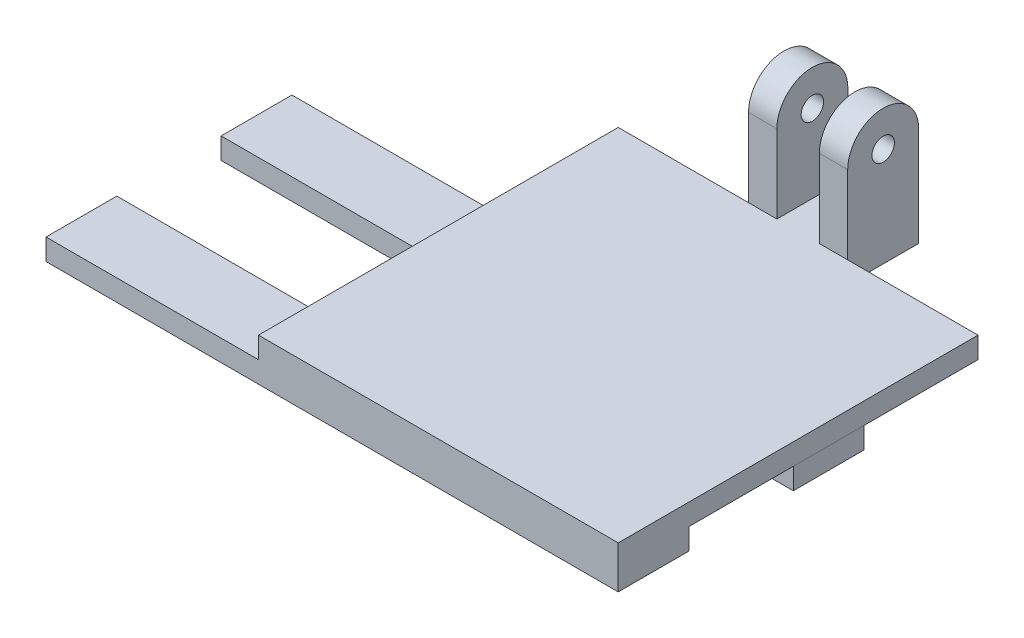
ISO-10303-21;
HEADER;
FILE_DESCRIPTION(('STEP AP214'),'2;1');
FILE_NAME('part.step','',(''),(''),'','','');
FILE_SCHEMA(('AUTOMOTIVE_DESIGN { 1 0 10303 214 1 1 1 1 }'));
ENDSEC;
DATA;
#1=APPLICATION_CONTEXT('core data for automotive mechanical design processes');
#2=APPLICATION_PROTOCOL_DEFINITION('international standard','automotive_design',2000,#1);
#3=PRODUCT_CONTEXT('',#1,'mechanical');
#4=PRODUCT('Part','Part','',(#3));
#5=PRODUCT_RELATED_PRODUCT_CATEGORY('part','',(#4));
#6=PRODUCT_DEFINITION_FORMATION('','',#4);
#7=PRODUCT_DEFINITION_CONTEXT('part definition',#1,'design');
#8=PRODUCT_DEFINITION('design','',#6,#7);
#9=PRODUCT_DEFINITION_SHAPE('','',#8);
#10=(LENGTH_UNIT() NAMED_UNIT(*) SI_UNIT(.MILLI.,.METRE.));
#11=(NAMED_UNIT(*) PLANE_ANGLE_UNIT() SI_UNIT($,.RADIAN.));
#12=(NAMED_UNIT(*) SI_UNIT($,.STERADIAN.) SOLID_ANGLE_UNIT());
#13=UNCERTAINTY_MEASURE_WITH_UNIT(LENGTH_MEASURE(1.E-05),#10,'distance_accuracy_value','');
#14=(GEOMETRIC_REPRESENTATION_CONTEXT(3) GLOBAL_UNCERTAINTY_ASSIGNED_CONTEXT((#13)) GLOBAL_UNIT_ASSIGNED_CONTEXT((#10,
#11,#12)) REPRESENTATION_CONTEXT('',''));
#15=CARTESIAN_POINT('',(0.,0.,0.));
#16=DIRECTION('',(0.,0.,1.));
#17=DIRECTION('',(1.,0.,0.));
#18=AXIS2_PLACEMENT_3D('',#15,#16,#17);
#19=CARTESIAN_POINT('',(0.,0.,0.));
#20=DIRECTION('',(0.,1.,0.));
#21=DIRECTION('',(0.,0.,1.));
#22=AXIS2_PLACEMENT_3D('',#19,#20,#21);
#23=PLANE('',#22);
#24=DIRECTION('',(-1.,0.,0.));
#25=VECTOR('',#24,1.);
#26=CARTESIAN_POINT('',(50.7963795894382,0.,-24.7232161308185));
#27=LINE('',#26,#25);
#28=CARTESIAN_POINT('',(50.7963795894382,0.,-24.7232161308185));
#29=VERTEX_POINT('',#28);
#30=CARTESIAN_POINT('',(0.,0.,-24.7232161308185));
#31=VERTEX_POINT('',#30);
#32=EDGE_CURVE('E57',#29,#31,#27,.T.);
#33=ORIENTED_EDGE('',*,*,#32,.F.);
#34=DIRECTION('',(0.,0.,1.));
#35=VECTOR('',#34,1.);
#36=CARTESIAN_POINT('',(50.7963795894382,0.,-24.7232161308185));
#37=LINE('',#36,#35);
#38=CARTESIAN_POINT('',(50.7963795894382,0.,-34.7232161308185));
#39=VERTEX_POINT('',#38);
#40=EDGE_CURVE('E62',#39,#29,#37,.T.);
#41=ORIENTED_EDGE('',*,*,#40,.F.);
#42=DIRECTION('',(1.,0.,0.));
#43=VECTOR('',#42,1.);
#44=CARTESIAN_POINT('',(50.7963795894382,0.,-34.7232161308185));
#45=LINE('',#44,#43);
#46=CARTESIAN_POINT('',(0.,0.,-34.7232161308185));
#47=VERTEX_POINT('',#46);
#48=EDGE_CURVE('E652',#47,#39,#45,.T.);
#49=ORIENTED_EDGE('',*,*,#48,.F.);
#50=DIRECTION('',(0.,0.,-1.));
#51=VECTOR('',#50,1.);
#52=CARTESIAN_POINT('',(0.,0.,0.));
#53=LINE('',#52,#51);
#54=CARTESIAN_POINT('',(0.,0.,-50.8));
#55=VERTEX_POINT('',#54);
#56=EDGE_CURVE('E326',#47,#55,#53,.T.);
#57=ORIENTED_EDGE('',*,*,#56,.T.);
#58=DIRECTION('',(1.,0.,0.));
#59=VECTOR('',#58,1.);
#60=CARTESIAN_POINT('',(0.,0.,-50.8));
#61=LINE('',#60,#59);
#62=CARTESIAN_POINT('',(18.4,0.,-50.8));
#63=VERTEX_POINT('',#62);
#64=EDGE_CURVE('E320',#55,#63,#61,.T.);
#65=ORIENTED_EDGE('',*,*,#64,.T.);
#66=DIRECTION('',(0.,0.,-1.));
#67=VECTOR('',#66,1.);
#68=CARTESIAN_POINT('',(18.4,0.,0.));
#69=LINE('',#68,#67);
#70=CARTESIAN_POINT('',(18.4,0.,-60.8232031516567));
#71=VERTEX_POINT('',#70);
#72=EDGE_CURVE('E262',#63,#71,#69,.T.);
#73=ORIENTED_EDGE('',*,*,#72,.T.);
#74=DIRECTION('',(1.,0.,0.));
#75=VECTOR('',#74,1.);
#76=CARTESIAN_POINT('',(0.,0.,-60.8232031516567));
#77=LINE('',#76,#75);
#78=CARTESIAN_POINT('',(32.4,0.,-60.8232031516567));
#79=VERTEX_POINT('',#78);
#80=EDGE_CURVE('E319',#71,#79,#77,.T.);
#81=ORIENTED_EDGE('',*,*,#80,.T.);
#82=DIRECTION('',(0.,0.,-1.));
#83=VECTOR('',#82,1.);
#84=CARTESIAN_POINT('',(32.4,0.,0.));
#85=LINE('',#84,#83);
#86=CARTESIAN_POINT('',(32.4,0.,-50.8));
#87=VERTEX_POINT('',#86);
#88=EDGE_CURVE('E277',#87,#79,#85,.T.);
#89=ORIENTED_EDGE('',*,*,#88,.F.);
#90=CARTESIAN_POINT('',(50.8,0.,-50.8));
#91=VERTEX_POINT('',#90);
#92=EDGE_CURVE('E316',#87,#91,#61,.T.);
#93=ORIENTED_EDGE('',*,*,#92,.T.);
#94=DIRECTION('',(0.,0.,-1.));
#95=VECTOR('',#94,1.);
#96=CARTESIAN_POINT('',(50.8,0.,0.));
#97=LINE('',#96,#95);
#98=CARTESIAN_POINT('',(50.8,0.,-10.));
#99=VERTEX_POINT('',#98);
#100=EDGE_CURVE('E289',#99,#91,#97,.T.);
#101=ORIENTED_EDGE('',*,*,#100,.F.);
#102=DIRECTION('',(1.,0.,0.));
#103=VECTOR('',#102,1.);
#104=CARTESIAN_POINT('',(-30.,0.,-10.));
#105=LINE('',#104,#103);
#106=CARTESIAN_POINT('',(0.,0.,-10.));
#107=VERTEX_POINT('',#106);
#108=EDGE_CURVE('E11',#107,#99,#105,.T.);
#109=ORIENTED_EDGE('',*,*,#108,.F.);
#110=EDGE_CURVE('E325',#107,#31,#53,.T.);
#111=ORIENTED_EDGE('',*,*,#110,.T.);
#112=EDGE_LOOP('',(#33,#41,#49,#57,#65,#73,#81,#89,#93,#101,#109,#111));
#113=FACE_BOUND('',#112,.T.);
#114=ADVANCED_FACE('F39',(#113),#23,.F.);
#115=CARTESIAN_POINT('',(0.,3.,-50.8));
#116=DIRECTION('',(0.,0.,-1.));
#117=DIRECTION('',(-1.,0.,0.));
#118=AXIS2_PLACEMENT_3D('',#115,#116,#117);
#119=PLANE('',#118);
#120=ORIENTED_EDGE('',*,*,#92,.F.);
#121=DIRECTION('',(0.,-1.,0.));
#122=VECTOR('',#121,1.);
#123=CARTESIAN_POINT('',(32.4,19.05,-50.8));
#124=LINE('',#123,#122);
#125=CARTESIAN_POINT('',(32.4,3.00000000000001,-50.8));
#126=VERTEX_POINT('',#125);
#127=EDGE_CURVE('E284',#126,#87,#124,.T.);
#128=ORIENTED_EDGE('',*,*,#127,.F.);
#129=DIRECTION('',(1.,0.,0.));
#130=VECTOR('',#129,1.);
#131=CARTESIAN_POINT('',(0.,3.,-50.8));
#132=LINE('',#131,#130);
#133=CARTESIAN_POINT('',(50.8,3.,-50.8));
#134=VERTEX_POINT('',#133);
#135=EDGE_CURVE('E297',#126,#134,#132,.T.);
#136=ORIENTED_EDGE('',*,*,#135,.T.);
#137=DIRECTION('',(0.,-1.,0.));
#138=VECTOR('',#137,1.);
#139=CARTESIAN_POINT('',(50.8,3.,-50.8));
#140=LINE('',#139,#138);
#141=EDGE_CURVE('E331',#134,#91,#140,.T.);
#142=ORIENTED_EDGE('',*,*,#141,.T.);
#143=EDGE_LOOP('',(#120,#128,#136,#142));
#144=FACE_BOUND('',#143,.T.);
#145=ADVANCED_FACE('F359',(#144),#119,.T.);
#146=CARTESIAN_POINT('',(0.,3.,0.));
#147=DIRECTION('',(0.,0.,-1.));
#148=DIRECTION('',(-1.,0.,0.));
#149=AXIS2_PLACEMENT_3D('',#146,#147,#148);
#150=PLANE('',#149);
#151=DIRECTION('',(0.,-1.,0.));
#152=VECTOR('',#151,1.);
#153=CARTESIAN_POINT('',(0.,3.,0.));
#154=LINE('',#153,#152);
#155=CARTESIAN_POINT('',(0.,3.,0.));
#156=VERTEX_POINT('',#155);
#157=CARTESIAN_POINT('',(0.,0.,0.));
#158=VERTEX_POINT('',#157);
#159=EDGE_CURVE('E314',#156,#158,#154,.T.);
#160=ORIENTED_EDGE('',*,*,#159,.T.);
#161=DIRECTION('',(-1.,0.,0.));
#162=VECTOR('',#161,1.);
#163=CARTESIAN_POINT('',(0.,0.,0.));
#164=LINE('',#163,#162);
#165=CARTESIAN_POINT('',(-30.,0.,0.));
#166=VERTEX_POINT('',#165);
#167=EDGE_CURVE('E210',#158,#166,#164,.T.);
#168=ORIENTED_EDGE('',*,*,#167,.T.);
#169=DIRECTION('',(0.,1.,0.));
#170=VECTOR('',#169,1.);
#171=CARTESIAN_POINT('',(-30.,-3.,0.));
#172=LINE('',#171,#170);
#173=CARTESIAN_POINT('',(-30.,-3.,0.));
#174=VERTEX_POINT('',#173);
#175=EDGE_CURVE('E235',#174,#166,#172,.T.);
#176=ORIENTED_EDGE('',*,*,#175,.F.);
#177=DIRECTION('',(-1.,0.,0.));
#178=VECTOR('',#177,1.);
#179=CARTESIAN_POINT('',(50.8,-3.,0.));
#180=LINE('',#179,#178);
#181=CARTESIAN_POINT('',(50.8,-3.,0.));
#182=VERTEX_POINT('',#181);
#183=EDGE_CURVE('E218',#182,#174,#180,.T.);
#184=ORIENTED_EDGE('',*,*,#183,.F.);
#185=DIRECTION('',(0.,-1.,0.));
#186=VECTOR('',#185,1.);
#187=CARTESIAN_POINT('',(50.8,3.,0.));
#188=LINE('',#187,#186);
#189=CARTESIAN_POINT('',(50.8,3.,0.));
#190=VERTEX_POINT('',#189);
#191=EDGE_CURVE('E48',#190,#182,#188,.T.);
#192=ORIENTED_EDGE('',*,*,#191,.F.);
#193=DIRECTION('',(1.,0.,0.));
#194=VECTOR('',#193,1.);
#195=CARTESIAN_POINT('',(0.,3.,0.));
#196=LINE('',#195,#194);
#197=EDGE_CURVE('E290',#156,#190,#196,.T.);
#198=ORIENTED_EDGE('',*,*,#197,.F.);
#199=EDGE_LOOP('',(#160,#168,#176,#184,#192,#198));
#200=FACE_BOUND('',#199,.T.);
#201=ADVANCED_FACE('F41',(#200),#150,.F.);
#202=CARTESIAN_POINT('',(50.8,3.,0.));
#203=DIRECTION('',(-1.,0.,0.));
#204=DIRECTION('',(0.,0.,1.));
#205=AXIS2_PLACEMENT_3D('',#202,#203,#204);
#206=PLANE('',#205);
#207=ORIENTED_EDGE('',*,*,#191,.T.);
#208=DIRECTION('',(0.,0.,1.));
#209=VECTOR('',#208,1.);
#210=CARTESIAN_POINT('',(50.8,-3.,-10.));
#211=LINE('',#210,#209);
#212=CARTESIAN_POINT('',(50.8,-3.,-10.));
#213=VERTEX_POINT('',#212);
#214=EDGE_CURVE('E224',#213,#182,#211,.T.);
#215=ORIENTED_EDGE('',*,*,#214,.F.);
#216=DIRECTION('',(0.,1.,0.));
#217=VECTOR('',#216,1.);
#218=CARTESIAN_POINT('',(50.8,-3.,-10.));
#219=LINE('',#218,#217);
#220=EDGE_CURVE('E226',#213,#99,#219,.T.);
#221=ORIENTED_EDGE('',*,*,#220,.T.);
#222=ORIENTED_EDGE('',*,*,#100,.T.);
#223=ORIENTED_EDGE('',*,*,#141,.F.);
#224=DIRECTION('',(0.,0.,-1.));
#225=VECTOR('',#224,1.);
#226=CARTESIAN_POINT('',(50.8,3.,0.));
#227=LINE('',#226,#225);
#228=EDGE_CURVE('E293',#190,#134,#227,.T.);
#229=ORIENTED_EDGE('',*,*,#228,.F.);
#230=EDGE_LOOP('',(#207,#215,#221,#222,#223,#229));
#231=FACE_BOUND('',#230,.T.);
#232=ADVANCED_FACE('F336',(#231),#206,.F.);
#233=CARTESIAN_POINT('',(0.,3.,-60.8232031516567));
#234=DIRECTION('',(0.,0.,-1.));
#235=DIRECTION('',(-1.,0.,0.));
#236=AXIS2_PLACEMENT_3D('',#233,#234,#235);
#237=PLANE('',#236);
#238=DIRECTION('',(1.,0.,0.));
#239=VECTOR('',#238,1.);
#240=CARTESIAN_POINT('',(13.35,14.0383984241718,-60.8232031516567));
#241=LINE('',#240,#239);
#242=CARTESIAN_POINT('',(28.4,14.0383984241718,-60.8232031516567));
#243=VERTEX_POINT('',#242);
#244=CARTESIAN_POINT('',(32.4,14.0383984241718,-60.8232031516567));
#245=VERTEX_POINT('',#244);
#246=EDGE_CURVE('E241',#243,#245,#241,.T.);
#247=ORIENTED_EDGE('',*,*,#246,.T.);
#248=DIRECTION('',(0.,-1.,0.));
#249=VECTOR('',#248,1.);
#250=CARTESIAN_POINT('',(32.4,19.05,-60.8232031516567));
#251=LINE('',#250,#249);
#252=EDGE_CURVE('E282',#245,#79,#251,.T.);
#253=ORIENTED_EDGE('',*,*,#252,.T.);
#254=ORIENTED_EDGE('',*,*,#80,.F.);
#255=DIRECTION('',(0.,-1.,0.));
#256=VECTOR('',#255,1.);
#257=CARTESIAN_POINT('',(18.4,19.05,-60.8232031516567));
#258=LINE('',#257,#256);
#259=CARTESIAN_POINT('',(18.4,14.0383984241718,-60.8232031516567));
#260=VERTEX_POINT('',#259);
#261=EDGE_CURVE('E268',#260,#71,#258,.T.);
#262=ORIENTED_EDGE('',*,*,#261,.F.);
#263=CARTESIAN_POINT('',(22.4,14.0383984241718,-60.8232031516567));
#264=VERTEX_POINT('',#263);
#265=EDGE_CURVE('E244',#260,#264,#241,.T.);
#266=ORIENTED_EDGE('',*,*,#265,.T.);
#267=DIRECTION('',(0.,-1.,0.));
#268=VECTOR('',#267,1.);
#269=CARTESIAN_POINT('',(22.4,19.05,-60.8232031516567));
#270=LINE('',#269,#268);
#271=CARTESIAN_POINT('',(22.4,3.00000000000001,-60.8232031516567));
#272=VERTEX_POINT('',#271);
#273=EDGE_CURVE('E270',#264,#272,#270,.T.);
#274=ORIENTED_EDGE('',*,*,#273,.T.);
#275=DIRECTION('',(1.,0.,0.));
#276=VECTOR('',#275,1.);
#277=CARTESIAN_POINT('',(0.,3.,-60.8232031516567));
#278=LINE('',#277,#276);
#279=CARTESIAN_POINT('',(28.4,3.00000000000001,-60.8232031516567));
#280=VERTEX_POINT('',#279);
#281=EDGE_CURVE('E305',#272,#280,#278,.T.);
#282=ORIENTED_EDGE('',*,*,#281,.T.);
#283=DIRECTION('',(0.,-1.,0.));
#284=VECTOR('',#283,1.);
#285=CARTESIAN_POINT('',(28.4,19.05,-60.8232031516567));
#286=LINE('',#285,#284);
#287=EDGE_CURVE('E280',#243,#280,#286,.T.);
#288=ORIENTED_EDGE('',*,*,#287,.F.);
#289=EDGE_LOOP('',(#247,#253,#254,#262,#266,#274,#282,#288));
#290=FACE_BOUND('',#289,.T.);
#291=ADVANCED_FACE('F399',(#290),#237,.T.);
#292=DIRECTION('',(0.,-1.,0.));
#293=VECTOR('',#292,1.);
#294=CARTESIAN_POINT('',(18.4,19.05,-50.8));
#295=LINE('',#294,#293);
#296=CARTESIAN_POINT('',(18.4,3.00000000000001,-50.8));
#297=VERTEX_POINT('',#296);
#298=EDGE_CURVE('E265',#297,#63,#295,.T.);
#299=ORIENTED_EDGE('',*,*,#298,.T.);
#300=ORIENTED_EDGE('',*,*,#64,.F.);
#301=DIRECTION('',(0.,-1.,0.));
#302=VECTOR('',#301,1.);
#303=CARTESIAN_POINT('',(0.,3.,-50.8));
#304=LINE('',#303,#302);
#305=CARTESIAN_POINT('',(0.,3.,-50.8));
#306=VERTEX_POINT('',#305);
#307=EDGE_CURVE('E328',#306,#55,#304,.T.);
#308=ORIENTED_EDGE('',*,*,#307,.F.);
#309=EDGE_CURVE('E302',#306,#297,#132,.T.);
#310=ORIENTED_EDGE('',*,*,#309,.T.);
#311=EDGE_LOOP('',(#299,#300,#308,#310));
#312=FACE_BOUND('',#311,.T.);
#313=ADVANCED_FACE('F392',(#312),#119,.T.);
#314=CARTESIAN_POINT('',(0.,3.,0.));
#315=DIRECTION('',(-1.,0.,0.));
#316=DIRECTION('',(0.,0.,1.));
#317=AXIS2_PLACEMENT_3D('',#314,#315,#316);
#318=PLANE('',#317);
#319=EDGE_CURVE('E294',#158,#107,#53,.T.);
#320=ORIENTED_EDGE('',*,*,#319,.F.);
#321=ORIENTED_EDGE('',*,*,#159,.F.);
#322=DIRECTION('',(0.,0.,-1.));
#323=VECTOR('',#322,1.);
#324=CARTESIAN_POINT('',(0.,3.,0.));
#325=LINE('',#324,#323);
#326=EDGE_CURVE('E311',#156,#306,#325,.T.);
#327=ORIENTED_EDGE('',*,*,#326,.T.);
#328=ORIENTED_EDGE('',*,*,#307,.T.);
#329=ORIENTED_EDGE('',*,*,#56,.F.);
#330=EDGE_CURVE('E657',#31,#47,#53,.T.);
#331=ORIENTED_EDGE('',*,*,#330,.F.);
#332=ORIENTED_EDGE('',*,*,#110,.F.);
#333=EDGE_LOOP('',(#320,#321,#327,#328,#329,#331,#332));
#334=FACE_BOUND('',#333,.T.);
#335=ADVANCED_FACE('F369',(#334),#318,.T.);
#336=CARTESIAN_POINT('',(0.,3.,0.));
#337=DIRECTION('',(0.,1.,0.));
#338=DIRECTION('',(0.,0.,1.));
#339=AXIS2_PLACEMENT_3D('',#336,#337,#338);
#340=PLANE('',#339);
#341=ORIENTED_EDGE('',*,*,#197,.T.);
#342=ORIENTED_EDGE('',*,*,#228,.T.);
#343=ORIENTED_EDGE('',*,*,#135,.F.);
#344=CARTESIAN_POINT('',(28.4,3.00000000000001,-50.8));
#345=VERTEX_POINT('',#344);
#346=EDGE_CURVE('E298',#345,#126,#132,.T.);
#347=ORIENTED_EDGE('',*,*,#346,.F.);
#348=DIRECTION('',(0.,0.,-1.));
#349=VECTOR('',#348,1.);
#350=CARTESIAN_POINT('',(28.4,3.,0.));
#351=LINE('',#350,#349);
#352=EDGE_CURVE('E301',#345,#280,#351,.T.);
#353=ORIENTED_EDGE('',*,*,#352,.T.);
#354=ORIENTED_EDGE('',*,*,#281,.F.);
#355=DIRECTION('',(0.,0.,-1.));
#356=VECTOR('',#355,1.);
#357=CARTESIAN_POINT('',(22.4,3.,0.));
#358=LINE('',#357,#356);
#359=CARTESIAN_POINT('',(22.4,3.00000000000001,-50.8));
#360=VERTEX_POINT('',#359);
#361=EDGE_CURVE('E308',#360,#272,#358,.T.);
#362=ORIENTED_EDGE('',*,*,#361,.F.);
#363=DIRECTION('',(-1.,0.,0.));
#364=VECTOR('',#363,1.);
#365=CARTESIAN_POINT('',(0.,3.,-50.8));
#366=LINE('',#365,#364);
#367=EDGE_CURVE('E274',#360,#297,#366,.T.);
#368=ORIENTED_EDGE('',*,*,#367,.T.);
#369=ORIENTED_EDGE('',*,*,#309,.F.);
#370=ORIENTED_EDGE('',*,*,#326,.F.);
#371=EDGE_LOOP('',(#341,#342,#343,#347,#353,#354,#362,#368,#369,#370));
#372=FACE_BOUND('',#371,.T.);
#373=ADVANCED_FACE('F363',(#372),#340,.T.);
#374=CARTESIAN_POINT('',(28.4,19.05,0.));
#375=DIRECTION('',(-1.,0.,0.));
#376=DIRECTION('',(0.,0.,1.));
#377=AXIS2_PLACEMENT_3D('',#374,#375,#376);
#378=PLANE('',#377);
#379=CARTESIAN_POINT('',(28.4,14.0383984241718,-55.8116015758283));
#380=DIRECTION('',(-1.,0.,0.));
#381=DIRECTION('',(0.,0.,1.));
#382=AXIS2_PLACEMENT_3D('',#379,#380,#381);
#383=CIRCLE('',#382,5.01160157582835);
#384=CARTESIAN_POINT('',(28.4,14.0383984241718,-50.8));
#385=VERTEX_POINT('',#384);
#386=EDGE_CURVE('E254',#243,#385,#383,.F.);
#387=ORIENTED_EDGE('',*,*,#386,.F.);
#388=ORIENTED_EDGE('',*,*,#287,.T.);
#389=ORIENTED_EDGE('',*,*,#352,.F.);
#390=DIRECTION('',(0.,-1.,0.));
#391=VECTOR('',#390,1.);
#392=CARTESIAN_POINT('',(28.4,19.05,-50.8));
#393=LINE('',#392,#391);
#394=EDGE_CURVE('E287',#385,#345,#393,.T.);
#395=ORIENTED_EDGE('',*,*,#394,.F.);
#396=EDGE_LOOP('',(#387,#388,#389,#395));
#397=FACE_BOUND('',#396,.T.);
#398=CARTESIAN_POINT('',(28.4,14.0383984241718,-55.8116015758283));
#399=DIRECTION('',(-1.,0.,0.));
#400=DIRECTION('',(0.,0.,1.));
#401=AXIS2_PLACEMENT_3D('',#398,#399,#400);
#402=CIRCLE('',#401,1.5875);
#403=CARTESIAN_POINT('',(28.4,14.0383984241718,-54.2241015758283));
#404=VERTEX_POINT('',#403);
#405=EDGE_CURVE('E259',#404,#404,#402,.T.);
#406=ORIENTED_EDGE('',*,*,#405,.F.);
#407=EDGE_LOOP('',(#406));
#408=FACE_BOUND('',#407,.T.);
#409=ADVANCED_FACE('F512',(#397,#408),#378,.T.);
#410=CARTESIAN_POINT('',(0.,19.05,-50.8));
#411=DIRECTION('',(0.,0.,-1.));
#412=DIRECTION('',(-1.,0.,0.));
#413=AXIS2_PLACEMENT_3D('',#410,#411,#412);
#414=PLANE('',#413);
#415=CARTESIAN_POINT('',(32.4,14.0383984241718,-50.8));
#416=VERTEX_POINT('',#415);
#417=EDGE_CURVE('E285',#416,#126,#124,.T.);
#418=ORIENTED_EDGE('',*,*,#417,.F.);
#419=DIRECTION('',(1.,0.,0.));
#420=VECTOR('',#419,1.);
#421=CARTESIAN_POINT('',(13.35,14.0383984241718,-50.8));
#422=LINE('',#421,#420);
#423=EDGE_CURVE('E240',#385,#416,#422,.T.);
#424=ORIENTED_EDGE('',*,*,#423,.F.);
#425=ORIENTED_EDGE('',*,*,#394,.T.);
#426=ORIENTED_EDGE('',*,*,#346,.T.);
#427=EDGE_LOOP('',(#418,#424,#425,#426));
#428=FACE_BOUND('',#427,.T.);
#429=ADVANCED_FACE('F428',(#428),#414,.F.);
#430=CARTESIAN_POINT('',(32.4,19.05,0.));
#431=DIRECTION('',(-1.,0.,0.));
#432=DIRECTION('',(0.,0.,1.));
#433=AXIS2_PLACEMENT_3D('',#430,#431,#432);
#434=PLANE('',#433);
#435=CARTESIAN_POINT('',(32.4,14.0383984241718,-55.8116015758283));
#436=DIRECTION('',(1.,0.,0.));
#437=DIRECTION('',(0.,0.,-1.));
#438=AXIS2_PLACEMENT_3D('',#435,#436,#437);
#439=CIRCLE('',#438,1.5875);
#440=CARTESIAN_POINT('',(32.4,14.0383984241718,-57.3991015758283));
#441=VERTEX_POINT('',#440);
#442=EDGE_CURVE('E247',#441,#441,#439,.T.);
#443=ORIENTED_EDGE('',*,*,#442,.F.);
#444=EDGE_LOOP('',(#443));
#445=FACE_BOUND('',#444,.T.);
#446=ORIENTED_EDGE('',*,*,#252,.F.);
#447=CARTESIAN_POINT('',(32.4,14.0383984241718,-55.8116015758283));
#448=DIRECTION('',(-1.,0.,0.));
#449=DIRECTION('',(0.,0.,1.));
#450=AXIS2_PLACEMENT_3D('',#447,#448,#449);
#451=CIRCLE('',#450,5.01160157582835);
#452=EDGE_CURVE('E238',#416,#245,#451,.T.);
#453=ORIENTED_EDGE('',*,*,#452,.F.);
#454=ORIENTED_EDGE('',*,*,#417,.T.);
#455=ORIENTED_EDGE('',*,*,#127,.T.);
#456=ORIENTED_EDGE('',*,*,#88,.T.);
#457=EDGE_LOOP('',(#446,#453,#454,#455,#456));
#458=FACE_BOUND('',#457,.T.);
#459=ADVANCED_FACE('F423',(#445,#458),#434,.F.);
#460=CARTESIAN_POINT('',(0.,19.05,-50.8));
#461=DIRECTION('',(0.,0.,-1.));
#462=DIRECTION('',(-1.,0.,0.));
#463=AXIS2_PLACEMENT_3D('',#460,#461,#462);
#464=PLANE('',#463);
#465=DIRECTION('',(0.,-1.,0.));
#466=VECTOR('',#465,1.);
#467=CARTESIAN_POINT('',(22.4,19.05,-50.8));
#468=LINE('',#467,#466);
#469=CARTESIAN_POINT('',(22.4,14.0383984241718,-50.8));
#470=VERTEX_POINT('',#469);
#471=EDGE_CURVE('E272',#470,#360,#468,.T.);
#472=ORIENTED_EDGE('',*,*,#471,.F.);
#473=CARTESIAN_POINT('',(18.4,14.0383984241718,-50.8));
#474=VERTEX_POINT('',#473);
#475=EDGE_CURVE('E245',#474,#470,#422,.T.);
#476=ORIENTED_EDGE('',*,*,#475,.F.);
#477=EDGE_CURVE('E266',#474,#297,#295,.T.);
#478=ORIENTED_EDGE('',*,*,#477,.T.);
#479=ORIENTED_EDGE('',*,*,#367,.F.);
#480=EDGE_LOOP('',(#472,#476,#478,#479));
#481=FACE_BOUND('',#480,.T.);
#482=ADVANCED_FACE('F427',(#481),#464,.F.);
#483=CARTESIAN_POINT('',(22.4,19.05,0.));
#484=DIRECTION('',(-1.,0.,0.));
#485=DIRECTION('',(0.,0.,1.));
#486=AXIS2_PLACEMENT_3D('',#483,#484,#485);
#487=PLANE('',#486);
#488=CARTESIAN_POINT('',(22.4,14.0383984241718,-55.8116015758283));
#489=DIRECTION('',(-1.,0.,0.));
#490=DIRECTION('',(0.,0.,1.));
#491=AXIS2_PLACEMENT_3D('',#488,#489,#490);
#492=CIRCLE('',#491,1.5875);
#493=CARTESIAN_POINT('',(22.4,14.0383984241718,-54.2241015758283));
#494=VERTEX_POINT('',#493);
#495=EDGE_CURVE('E256',#494,#494,#492,.T.);
#496=ORIENTED_EDGE('',*,*,#495,.T.);
#497=EDGE_LOOP('',(#496));
#498=FACE_BOUND('',#497,.T.);
#499=ORIENTED_EDGE('',*,*,#273,.F.);
#500=CARTESIAN_POINT('',(22.4,14.0383984241718,-55.8116015758283));
#501=DIRECTION('',(-1.,0.,0.));
#502=DIRECTION('',(0.,0.,1.));
#503=AXIS2_PLACEMENT_3D('',#500,#501,#502);
#504=CIRCLE('',#503,5.01160157582835);
#505=EDGE_CURVE('E252',#264,#470,#504,.F.);
#506=ORIENTED_EDGE('',*,*,#505,.T.);
#507=ORIENTED_EDGE('',*,*,#471,.T.);
#508=ORIENTED_EDGE('',*,*,#361,.T.);
#509=EDGE_LOOP('',(#499,#506,#507,#508));
#510=FACE_BOUND('',#509,.T.);
#511=ADVANCED_FACE('F443',(#498,#510),#487,.F.);
#512=CARTESIAN_POINT('',(18.4,19.05,0.));
#513=DIRECTION('',(-1.,0.,0.));
#514=DIRECTION('',(0.,0.,1.));
#515=AXIS2_PLACEMENT_3D('',#512,#513,#514);
#516=PLANE('',#515);
#517=CARTESIAN_POINT('',(18.4,14.0383984241718,-55.8116015758283));
#518=DIRECTION('',(-1.,0.,0.));
#519=DIRECTION('',(0.,0.,1.));
#520=AXIS2_PLACEMENT_3D('',#517,#518,#519);
#521=CIRCLE('',#520,5.01160157582835);
#522=EDGE_CURVE('E250',#260,#474,#521,.F.);
#523=ORIENTED_EDGE('',*,*,#522,.F.);
#524=ORIENTED_EDGE('',*,*,#261,.T.);
#525=ORIENTED_EDGE('',*,*,#72,.F.);
#526=ORIENTED_EDGE('',*,*,#298,.F.);
#527=ORIENTED_EDGE('',*,*,#477,.F.);
#528=EDGE_LOOP('',(#523,#524,#525,#526,#527));
#529=FACE_BOUND('',#528,.T.);
#530=CARTESIAN_POINT('',(18.4,14.0383984241718,-55.8116015758283));
#531=DIRECTION('',(-1.,0.,0.));
#532=DIRECTION('',(0.,0.,1.));
#533=AXIS2_PLACEMENT_3D('',#530,#531,#532);
#534=CIRCLE('',#533,1.5875);
#535=CARTESIAN_POINT('',(18.4,14.0383984241718,-54.2241015758283));
#536=VERTEX_POINT('',#535);
#537=EDGE_CURVE('E43',#536,#536,#534,.T.);
#538=ORIENTED_EDGE('',*,*,#537,.F.);
#539=EDGE_LOOP('',(#538));
#540=FACE_BOUND('',#539,.T.);
#541=ADVANCED_FACE('F438',(#529,#540),#516,.T.);
#542=CARTESIAN_POINT('',(13.35,14.0383984241718,-55.8116015758283));
#543=DIRECTION('',(1.,0.,0.));
#544=DIRECTION('',(0.,0.,-1.));
#545=AXIS2_PLACEMENT_3D('',#542,#543,#544);
#546=CYLINDRICAL_SURFACE('',#545,1.5875);
#547=ORIENTED_EDGE('',*,*,#537,.T.);
#548=EDGE_LOOP('',(#547));
#549=FACE_BOUND('',#548,.T.);
#550=ORIENTED_EDGE('',*,*,#495,.F.);
#551=EDGE_LOOP('',(#550));
#552=FACE_BOUND('',#551,.T.);
#553=ADVANCED_FACE('F442',(#549,#552),#546,.F.);
#554=CARTESIAN_POINT('',(13.35,14.0383984241718,-55.8116015758283));
#555=DIRECTION('',(1.,0.,0.));
#556=DIRECTION('',(0.,0.,-1.));
#557=AXIS2_PLACEMENT_3D('',#554,#555,#556);
#558=CYLINDRICAL_SURFACE('',#557,5.01160157582835);
#559=ORIENTED_EDGE('',*,*,#265,.F.);
#560=ORIENTED_EDGE('',*,*,#522,.T.);
#561=ORIENTED_EDGE('',*,*,#475,.T.);
#562=ORIENTED_EDGE('',*,*,#505,.F.);
#563=EDGE_LOOP('',(#559,#560,#561,#562));
#564=FACE_BOUND('',#563,.T.);
#565=ADVANCED_FACE('F383',(#564),#558,.T.);
#566=ORIENTED_EDGE('',*,*,#405,.T.);
#567=EDGE_LOOP('',(#566));
#568=FACE_BOUND('',#567,.T.);
#569=ORIENTED_EDGE('',*,*,#442,.T.);
#570=EDGE_LOOP('',(#569));
#571=FACE_BOUND('',#570,.T.);
#572=ADVANCED_FACE('F380',(#568,#571),#546,.F.);
#573=ORIENTED_EDGE('',*,*,#386,.T.);
#574=ORIENTED_EDGE('',*,*,#423,.T.);
#575=ORIENTED_EDGE('',*,*,#452,.T.);
#576=ORIENTED_EDGE('',*,*,#246,.F.);
#577=EDGE_LOOP('',(#573,#574,#575,#576));
#578=FACE_BOUND('',#577,.T.);
#579=ADVANCED_FACE('F373',(#578),#558,.T.);
#580=CARTESIAN_POINT('',(0.,0.,0.));
#581=DIRECTION('',(0.,-1.,0.));
#582=DIRECTION('',(0.,0.,-1.));
#583=AXIS2_PLACEMENT_3D('',#580,#581,#582);
#584=PLANE('',#583);
#585=ORIENTED_EDGE('',*,*,#167,.F.);
#586=ORIENTED_EDGE('',*,*,#319,.T.);
#587=CARTESIAN_POINT('',(-30.,0.,-10.));
#588=VERTEX_POINT('',#587);
#589=EDGE_CURVE('E50',#588,#107,#105,.T.);
#590=ORIENTED_EDGE('',*,*,#589,.F.);
#591=DIRECTION('',(0.,0.,-1.));
#592=VECTOR('',#591,1.);
#593=CARTESIAN_POINT('',(-30.,0.,0.));
#594=LINE('',#593,#592);
#595=EDGE_CURVE('E212',#166,#588,#594,.T.);
#596=ORIENTED_EDGE('',*,*,#595,.F.);
#597=EDGE_LOOP('',(#585,#586,#590,#596));
#598=FACE_BOUND('',#597,.T.);
#599=ADVANCED_FACE('F371',(#598),#584,.F.);
#600=CARTESIAN_POINT('',(-30.,-3.,0.));
#601=DIRECTION('',(1.,0.,0.));
#602=DIRECTION('',(0.,0.,-1.));
#603=AXIS2_PLACEMENT_3D('',#600,#601,#602);
#604=PLANE('',#603);
#605=ORIENTED_EDGE('',*,*,#595,.T.);
#606=DIRECTION('',(0.,1.,0.));
#607=VECTOR('',#606,1.);
#608=CARTESIAN_POINT('',(-30.,-3.,-10.));
#609=LINE('',#608,#607);
#610=CARTESIAN_POINT('',(-30.,-3.,-10.));
#611=VERTEX_POINT('',#610);
#612=EDGE_CURVE('E232',#611,#588,#609,.T.);
#613=ORIENTED_EDGE('',*,*,#612,.F.);
#614=DIRECTION('',(0.,0.,-1.));
#615=VECTOR('',#614,1.);
#616=CARTESIAN_POINT('',(-30.,-3.,0.));
#617=LINE('',#616,#615);
#618=EDGE_CURVE('E220',#174,#611,#617,.T.);
#619=ORIENTED_EDGE('',*,*,#618,.F.);
#620=ORIENTED_EDGE('',*,*,#175,.T.);
#621=EDGE_LOOP('',(#605,#613,#619,#620));
#622=FACE_BOUND('',#621,.T.);
#623=ADVANCED_FACE('F351',(#622),#604,.F.);
#624=CARTESIAN_POINT('',(-30.,-3.,-10.));
#625=DIRECTION('',(0.,0.,1.));
#626=DIRECTION('',(1.,0.,0.));
#627=AXIS2_PLACEMENT_3D('',#624,#625,#626);
#628=PLANE('',#627);
#629=ORIENTED_EDGE('',*,*,#589,.T.);
#630=ORIENTED_EDGE('',*,*,#108,.T.);
#631=ORIENTED_EDGE('',*,*,#220,.F.);
#632=DIRECTION('',(1.,0.,0.));
#633=VECTOR('',#632,1.);
#634=CARTESIAN_POINT('',(-30.,-3.,-10.));
#635=LINE('',#634,#633);
#636=EDGE_CURVE('E222',#611,#213,#635,.T.);
#637=ORIENTED_EDGE('',*,*,#636,.F.);
#638=ORIENTED_EDGE('',*,*,#612,.T.);
#639=EDGE_LOOP('',(#629,#630,#631,#637,#638));
#640=FACE_BOUND('',#639,.T.);
#641=ADVANCED_FACE('F354',(#640),#628,.F.);
#642=CARTESIAN_POINT('',(0.,-3.,0.));
#643=DIRECTION('',(0.,-1.,0.));
#644=DIRECTION('',(0.,0.,-1.));
#645=AXIS2_PLACEMENT_3D('',#642,#643,#644);
#646=PLANE('',#645);
#647=ORIENTED_EDGE('',*,*,#183,.T.);
#648=ORIENTED_EDGE('',*,*,#618,.T.);
#649=ORIENTED_EDGE('',*,*,#636,.T.);
#650=ORIENTED_EDGE('',*,*,#214,.T.);
#651=EDGE_LOOP('',(#647,#648,#649,#650));
#652=FACE_BOUND('',#651,.T.);
#653=ADVANCED_FACE('F342',(#652),#646,.T.);
#654=CARTESIAN_POINT('',(50.7963795894382,-3.,-24.7232161308185));
#655=DIRECTION('',(-1.,0.,0.));
#656=DIRECTION('',(0.,0.,1.));
#657=AXIS2_PLACEMENT_3D('',#654,#655,#656);
#658=PLANE('',#657);
#659=ORIENTED_EDGE('',*,*,#40,.T.);
#660=DIRECTION('',(0.,1.,0.));
#661=VECTOR('',#660,1.);
#662=CARTESIAN_POINT('',(50.7963795894382,-3.,-24.7232161308185));
#663=LINE('',#662,#661);
#664=CARTESIAN_POINT('',(50.7963795894382,-3.,-24.7232161308185));
#665=VERTEX_POINT('',#664);
#666=EDGE_CURVE('E192',#665,#29,#663,.T.);
#667=ORIENTED_EDGE('',*,*,#666,.F.);
#668=DIRECTION('',(0.,0.,1.));
#669=VECTOR('',#668,1.);
#670=CARTESIAN_POINT('',(50.7963795894382,-3.,-24.7232161308185));
#671=LINE('',#670,#669);
#672=CARTESIAN_POINT('',(50.7963795894382,-3.,-34.7232161308185));
#673=VERTEX_POINT('',#672);
#674=EDGE_CURVE('E198',#673,#665,#671,.T.);
#675=ORIENTED_EDGE('',*,*,#674,.F.);
#676=DIRECTION('',(0.,1.,0.));
#677=VECTOR('',#676,1.);
#678=CARTESIAN_POINT('',(50.7963795894382,-3.,-34.7232161308185));
#679=LINE('',#678,#677);
#680=EDGE_CURVE('E655',#673,#39,#679,.T.);
#681=ORIENTED_EDGE('',*,*,#680,.T.);
#682=EDGE_LOOP('',(#659,#667,#675,#681));
#683=FACE_BOUND('',#682,.T.);
#684=ADVANCED_FACE('F209',(#683),#658,.F.);
#685=CARTESIAN_POINT('',(50.7963795894382,-3.,-24.7232161308185));
#686=DIRECTION('',(0.,0.,-1.));
#687=DIRECTION('',(-1.,0.,0.));
#688=AXIS2_PLACEMENT_3D('',#685,#686,#687);
#689=PLANE('',#688);
#690=ORIENTED_EDGE('',*,*,#32,.T.);
#691=CARTESIAN_POINT('',(-30.,0.,-24.7232161308185));
#692=VERTEX_POINT('',#691);
#693=EDGE_CURVE('E664',#31,#692,#27,.T.);
#694=ORIENTED_EDGE('',*,*,#693,.T.);
#695=DIRECTION('',(0.,1.,0.));
#696=VECTOR('',#695,1.);
#697=CARTESIAN_POINT('',(-30.,-3.,-24.7232161308185));
#698=LINE('',#697,#696);
#699=CARTESIAN_POINT('',(-30.,-3.,-24.7232161308185));
#700=VERTEX_POINT('',#699);
#701=EDGE_CURVE('E194',#700,#692,#698,.T.);
#702=ORIENTED_EDGE('',*,*,#701,.F.);
#703=DIRECTION('',(-1.,0.,0.));
#704=VECTOR('',#703,1.);
#705=CARTESIAN_POINT('',(50.7963795894382,-3.,-24.7232161308185));
#706=LINE('',#705,#704);
#707=EDGE_CURVE('E188',#665,#700,#706,.T.);
#708=ORIENTED_EDGE('',*,*,#707,.F.);
#709=ORIENTED_EDGE('',*,*,#666,.T.);
#710=EDGE_LOOP('',(#690,#694,#702,#708,#709));
#711=FACE_BOUND('',#710,.T.);
#712=ADVANCED_FACE('F190',(#711),#689,.F.);
#713=CARTESIAN_POINT('',(-30.,-3.,-24.7232161308185));
#714=DIRECTION('',(1.,0.,0.));
#715=DIRECTION('',(0.,0.,-1.));
#716=AXIS2_PLACEMENT_3D('',#713,#714,#715);
#717=PLANE('',#716);
#718=DIRECTION('',(0.,0.,-1.));
#719=VECTOR('',#718,1.);
#720=CARTESIAN_POINT('',(-30.,0.,-24.7232161308185));
#721=LINE('',#720,#719);
#722=CARTESIAN_POINT('',(-30.,0.,-34.7232161308185));
#723=VERTEX_POINT('',#722);
#724=EDGE_CURVE('E648',#692,#723,#721,.T.);
#725=ORIENTED_EDGE('',*,*,#724,.T.);
#726=DIRECTION('',(0.,1.,0.));
#727=VECTOR('',#726,1.);
#728=CARTESIAN_POINT('',(-30.,-3.,-34.7232161308185));
#729=LINE('',#728,#727);
#730=CARTESIAN_POINT('',(-30.,-3.,-34.7232161308185));
#731=VERTEX_POINT('',#730);
#732=EDGE_CURVE('E214',#731,#723,#729,.T.);
#733=ORIENTED_EDGE('',*,*,#732,.F.);
#734=DIRECTION('',(0.,0.,-1.));
#735=VECTOR('',#734,1.);
#736=CARTESIAN_POINT('',(-30.,-3.,-24.7232161308185));
#737=LINE('',#736,#735);
#738=EDGE_CURVE('E197',#700,#731,#737,.T.);
#739=ORIENTED_EDGE('',*,*,#738,.F.);
#740=ORIENTED_EDGE('',*,*,#701,.T.);
#741=EDGE_LOOP('',(#725,#733,#739,#740));
#742=FACE_BOUND('',#741,.T.);
#743=ADVANCED_FACE('F464',(#742),#717,.F.);
#744=CARTESIAN_POINT('',(50.7963795894382,-3.,-34.7232161308185));
#745=DIRECTION('',(0.,0.,1.));
#746=DIRECTION('',(1.,0.,0.));
#747=AXIS2_PLACEMENT_3D('',#744,#745,#746);
#748=PLANE('',#747);
#749=EDGE_CURVE('E207',#723,#47,#45,.T.);
#750=ORIENTED_EDGE('',*,*,#749,.T.);
#751=ORIENTED_EDGE('',*,*,#48,.T.);
#752=ORIENTED_EDGE('',*,*,#680,.F.);
#753=DIRECTION('',(1.,0.,0.));
#754=VECTOR('',#753,1.);
#755=CARTESIAN_POINT('',(50.7963795894382,-3.,-34.7232161308185));
#756=LINE('',#755,#754);
#757=EDGE_CURVE('E203',#731,#673,#756,.T.);
#758=ORIENTED_EDGE('',*,*,#757,.F.);
#759=ORIENTED_EDGE('',*,*,#732,.T.);
#760=EDGE_LOOP('',(#750,#751,#752,#758,#759));
#761=FACE_BOUND('',#760,.T.);
#762=ADVANCED_FACE('F473',(#761),#748,.F.);
#763=CARTESIAN_POINT('',(0.,-3.,0.));
#764=DIRECTION('',(0.,1.,0.));
#765=DIRECTION('',(0.,0.,1.));
#766=AXIS2_PLACEMENT_3D('',#763,#764,#765);
#767=PLANE('',#766);
#768=ORIENTED_EDGE('',*,*,#674,.T.);
#769=ORIENTED_EDGE('',*,*,#707,.T.);
#770=ORIENTED_EDGE('',*,*,#738,.T.);
#771=ORIENTED_EDGE('',*,*,#757,.T.);
#772=EDGE_LOOP('',(#768,#769,#770,#771));
#773=FACE_BOUND('',#772,.T.);
#774=ADVANCED_FACE('F201',(#773),#767,.F.);
#775=CARTESIAN_POINT('',(0.,0.,0.));
#776=DIRECTION('',(0.,1.,0.));
#777=DIRECTION('',(0.,0.,1.));
#778=AXIS2_PLACEMENT_3D('',#775,#776,#777);
#779=PLANE('',#778);
#780=ORIENTED_EDGE('',*,*,#693,.F.);
#781=ORIENTED_EDGE('',*,*,#330,.T.);
#782=ORIENTED_EDGE('',*,*,#749,.F.);
#783=ORIENTED_EDGE('',*,*,#724,.F.);
#784=EDGE_LOOP('',(#780,#781,#782,#783));
#785=FACE_BOUND('',#784,.T.);
#786=ADVANCED_FACE('F497',(#785),#779,.T.);
#787=CLOSED_SHELL('',(#114,#145,#201,#232,#291,#313,#335,#373,#409,#429,#459,#482,#511,#541,
#553,#565,#572,#579,#599,#623,#641,#653,#684,#712,#743,#762,#774,#786));
#788=MANIFOLD_SOLID_BREP('B2',#787);
#789=ADVANCED_BREP_SHAPE_REPRESENTATION('',(#18,#788),#14);
#790=SHAPE_DEFINITION_REPRESENTATION(#9,#789);
ENDSEC;
END-ISO-10303-21;
